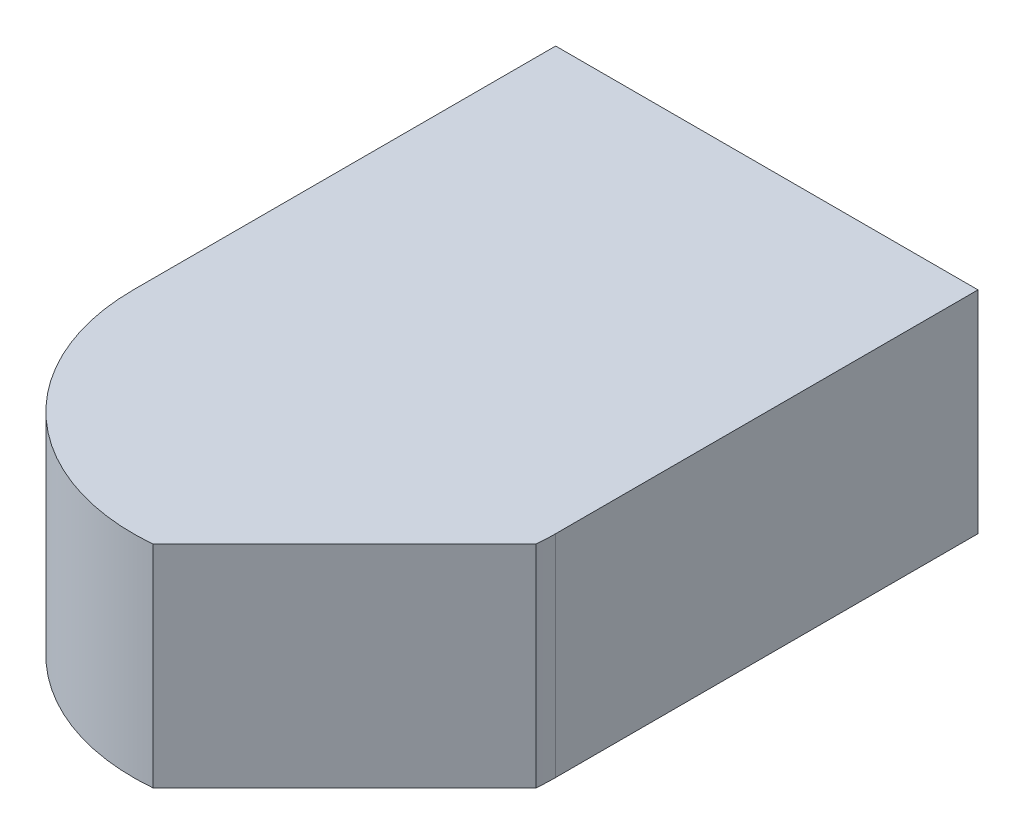
ISO-10303-21;
HEADER;
FILE_DESCRIPTION(('STEP AP214'),'2;1');
FILE_NAME('part.step','',(''),(''),'','','');
FILE_SCHEMA(('AUTOMOTIVE_DESIGN { 1 0 10303 214 1 1 1 1 }'));
ENDSEC;
DATA;
#1=APPLICATION_CONTEXT('core data for automotive mechanical design processes');
#2=APPLICATION_PROTOCOL_DEFINITION('international standard','automotive_design',2000,#1);
#3=PRODUCT_CONTEXT('',#1,'mechanical');
#4=PRODUCT('Part','Part','',(#3));
#5=PRODUCT_RELATED_PRODUCT_CATEGORY('part','',(#4));
#6=PRODUCT_DEFINITION_FORMATION('','',#4);
#7=PRODUCT_DEFINITION_CONTEXT('part definition',#1,'design');
#8=PRODUCT_DEFINITION('design','',#6,#7);
#9=PRODUCT_DEFINITION_SHAPE('','',#8);
#10=(LENGTH_UNIT() NAMED_UNIT(*) SI_UNIT(.MILLI.,.METRE.));
#11=(NAMED_UNIT(*) PLANE_ANGLE_UNIT() SI_UNIT($,.RADIAN.));
#12=(NAMED_UNIT(*) SI_UNIT($,.STERADIAN.) SOLID_ANGLE_UNIT());
#13=UNCERTAINTY_MEASURE_WITH_UNIT(LENGTH_MEASURE(1.E-05),#10,'distance_accuracy_value','');
#14=(GEOMETRIC_REPRESENTATION_CONTEXT(3) GLOBAL_UNCERTAINTY_ASSIGNED_CONTEXT((#13)) GLOBAL_UNIT_ASSIGNED_CONTEXT((#10,
#11,#12)) REPRESENTATION_CONTEXT('',''));
#15=CARTESIAN_POINT('',(0.,0.,0.));
#16=DIRECTION('',(0.,0.,1.));
#17=DIRECTION('',(1.,0.,0.));
#18=AXIS2_PLACEMENT_3D('',#15,#16,#17);
#19=CARTESIAN_POINT('',(0.,0.,0.));
#20=DIRECTION('',(0.,1.,0.));
#21=DIRECTION('',(1.,0.,0.));
#22=AXIS2_PLACEMENT_3D('',#19,#20,#21);
#23=PLANE('',#22);
#24=CARTESIAN_POINT('',(0.8,0.,-2.05));
#25=DIRECTION('',(0.,1.,0.));
#26=DIRECTION('',(-1.,0.,0.));
#27=AXIS2_PLACEMENT_3D('',#24,#25,#26);
#28=CIRCLE('',#27,0.1);
#29=CARTESIAN_POINT('',(0.7,0.,-2.05));
#30=VERTEX_POINT('',#29);
#31=CARTESIAN_POINT('',(0.808982925758,0.,-1.950404281996));
#32=VERTEX_POINT('',#31);
#33=EDGE_CURVE('E11',#30,#32,#28,.T.);
#34=ORIENTED_EDGE('',*,*,#33,.F.);
#35=DIRECTION('',(0.,0.,1.));
#36=VECTOR('',#35,1.);
#37=CARTESIAN_POINT('',(0.7,0.,-2.25));
#38=LINE('',#37,#36);
#39=CARTESIAN_POINT('',(0.7,0.,-2.25));
#40=VERTEX_POINT('',#39);
#41=EDGE_CURVE('E25',#40,#30,#38,.T.);
#42=ORIENTED_EDGE('',*,*,#41,.F.);
#43=DIRECTION('',(-1.,0.,0.));
#44=VECTOR('',#43,1.);
#45=CARTESIAN_POINT('',(0.9,0.,-2.25));
#46=LINE('',#45,#44);
#47=CARTESIAN_POINT('',(0.9,0.,-2.25));
#48=VERTEX_POINT('',#47);
#49=EDGE_CURVE('E145',#48,#40,#46,.T.);
#50=ORIENTED_EDGE('',*,*,#49,.F.);
#51=DIRECTION('',(0.,0.,-1.));
#52=VECTOR('',#51,1.);
#53=CARTESIAN_POINT('',(0.9,0.,-2.05));
#54=LINE('',#53,#52);
#55=CARTESIAN_POINT('',(0.9,0.,-2.05));
#56=VERTEX_POINT('',#55);
#57=EDGE_CURVE('E141',#56,#48,#54,.T.);
#58=ORIENTED_EDGE('',*,*,#57,.F.);
#59=CARTESIAN_POINT('',(0.8,0.,-2.05));
#60=DIRECTION('',(0.,1.,0.));
#61=DIRECTION('',(0.995957180044505,0.,0.0898292575823554));
#62=AXIS2_PLACEMENT_3D('',#59,#60,#61);
#63=CIRCLE('',#62,0.1);
#64=CARTESIAN_POINT('',(0.899595718005,0.,-2.041017074242));
#65=VERTEX_POINT('',#64);
#66=EDGE_CURVE('E89',#65,#56,#63,.T.);
#67=ORIENTED_EDGE('',*,*,#66,.F.);
#68=DIRECTION('',(-0.707106781186548,0.,0.707106781186548));
#69=VECTOR('',#68,1.);
#70=CARTESIAN_POINT('',(0.899595718005,0.,-2.041017074242));
#71=LINE('',#70,#69);
#72=EDGE_CURVE('E134',#65,#32,#71,.T.);
#73=ORIENTED_EDGE('',*,*,#72,.T.);
#74=EDGE_LOOP('',(#34,#42,#50,#58,#67,#73));
#75=FACE_BOUND('',#74,.T.);
#76=ADVANCED_FACE('F17',(#75),#23,.F.);
#77=CARTESIAN_POINT('',(0.899595718005,-0.02,-2.041017074242));
#78=DIRECTION('',(-0.707106781186548,0.,-0.707106781186548));
#79=DIRECTION('',(-0.707106781186548,0.,0.707106781186548));
#80=AXIS2_PLACEMENT_3D('',#77,#78,#79);
#81=PLANE('',#80);
#82=DIRECTION('',(0.,1.,0.));
#83=VECTOR('',#82,1.);
#84=CARTESIAN_POINT('',(0.899595718004,0.,-2.041017074242));
#85=LINE('',#84,#83);
#86=CARTESIAN_POINT('',(0.899595718004,0.1,-2.041017074242));
#87=VERTEX_POINT('',#86);
#88=EDGE_CURVE('E130',#65,#87,#85,.T.);
#89=ORIENTED_EDGE('',*,*,#88,.T.);
#90=DIRECTION('',(-0.707106781186548,0.,0.707106781186548));
#91=VECTOR('',#90,1.);
#92=CARTESIAN_POINT('',(0.899595718004,0.1,-2.041017074242));
#93=LINE('',#92,#91);
#94=CARTESIAN_POINT('',(0.808982925758,0.1,-1.950404281996));
#95=VERTEX_POINT('',#94);
#96=EDGE_CURVE('E84',#87,#95,#93,.T.);
#97=ORIENTED_EDGE('',*,*,#96,.T.);
#98=DIRECTION('',(0.,1.,0.));
#99=VECTOR('',#98,1.);
#100=CARTESIAN_POINT('',(0.808982925758,0.,-1.950404281996));
#101=LINE('',#100,#99);
#102=EDGE_CURVE('E122',#32,#95,#101,.T.);
#103=ORIENTED_EDGE('',*,*,#102,.F.);
#104=ORIENTED_EDGE('',*,*,#72,.F.);
#105=EDGE_LOOP('',(#89,#97,#103,#104));
#106=FACE_BOUND('',#105,.T.);
#107=ADVANCED_FACE('F161',(#106),#81,.F.);
#108=CARTESIAN_POINT('',(0.8,0.,-2.05));
#109=DIRECTION('',(0.,1.,0.));
#110=DIRECTION('',(0.674600156544445,0.,-0.738183330067952));
#111=AXIS2_PLACEMENT_3D('',#108,#109,#110);
#112=CYLINDRICAL_SURFACE('',#111,0.1);
#113=CARTESIAN_POINT('',(0.8,0.1,-2.05));
#114=DIRECTION('',(0.,1.,0.));
#115=DIRECTION('',(-1.,0.,0.));
#116=AXIS2_PLACEMENT_3D('',#113,#114,#115);
#117=CIRCLE('',#116,0.1);
#118=CARTESIAN_POINT('',(0.7,0.1,-2.05));
#119=VERTEX_POINT('',#118);
#120=EDGE_CURVE('E118',#119,#95,#117,.T.);
#121=ORIENTED_EDGE('',*,*,#120,.F.);
#122=DIRECTION('',(0.,1.,0.));
#123=VECTOR('',#122,1.);
#124=CARTESIAN_POINT('',(0.7,0.,-2.05));
#125=LINE('',#124,#123);
#126=EDGE_CURVE('E113',#30,#119,#125,.T.);
#127=ORIENTED_EDGE('',*,*,#126,.F.);
#128=ORIENTED_EDGE('',*,*,#33,.T.);
#129=ORIENTED_EDGE('',*,*,#102,.T.);
#130=EDGE_LOOP('',(#121,#127,#128,#129));
#131=FACE_BOUND('',#130,.T.);
#132=ADVANCED_FACE('F163',(#131),#112,.T.);
#133=CARTESIAN_POINT('',(0.7,0.,-2.25));
#134=DIRECTION('',(-1.,0.,0.));
#135=DIRECTION('',(0.,0.,1.));
#136=AXIS2_PLACEMENT_3D('',#133,#134,#135);
#137=PLANE('',#136);
#138=ORIENTED_EDGE('',*,*,#126,.T.);
#139=DIRECTION('',(0.,0.,1.));
#140=VECTOR('',#139,1.);
#141=CARTESIAN_POINT('',(0.7,0.1,-2.25));
#142=LINE('',#141,#140);
#143=CARTESIAN_POINT('',(0.7,0.1,-2.25));
#144=VERTEX_POINT('',#143);
#145=EDGE_CURVE('E108',#144,#119,#142,.T.);
#146=ORIENTED_EDGE('',*,*,#145,.F.);
#147=DIRECTION('',(0.,1.,0.));
#148=VECTOR('',#147,1.);
#149=CARTESIAN_POINT('',(0.7,0.,-2.25));
#150=LINE('',#149,#148);
#151=EDGE_CURVE('E103',#40,#144,#150,.T.);
#152=ORIENTED_EDGE('',*,*,#151,.F.);
#153=ORIENTED_EDGE('',*,*,#41,.T.);
#154=EDGE_LOOP('',(#138,#146,#152,#153));
#155=FACE_BOUND('',#154,.T.);
#156=ADVANCED_FACE('F155',(#155),#137,.T.);
#157=CARTESIAN_POINT('',(0.9,0.,-2.25));
#158=DIRECTION('',(0.,0.,-1.));
#159=DIRECTION('',(-1.,0.,0.));
#160=AXIS2_PLACEMENT_3D('',#157,#158,#159);
#161=PLANE('',#160);
#162=ORIENTED_EDGE('',*,*,#151,.T.);
#163=DIRECTION('',(-1.,0.,0.));
#164=VECTOR('',#163,1.);
#165=CARTESIAN_POINT('',(0.9,0.1,-2.25));
#166=LINE('',#165,#164);
#167=CARTESIAN_POINT('',(0.9,0.1,-2.25));
#168=VERTEX_POINT('',#167);
#169=EDGE_CURVE('E99',#168,#144,#166,.T.);
#170=ORIENTED_EDGE('',*,*,#169,.F.);
#171=DIRECTION('',(0.,1.,0.));
#172=VECTOR('',#171,1.);
#173=CARTESIAN_POINT('',(0.9,0.,-2.25));
#174=LINE('',#173,#172);
#175=EDGE_CURVE('E75',#48,#168,#174,.T.);
#176=ORIENTED_EDGE('',*,*,#175,.F.);
#177=ORIENTED_EDGE('',*,*,#49,.T.);
#178=EDGE_LOOP('',(#162,#170,#176,#177));
#179=FACE_BOUND('',#178,.T.);
#180=ADVANCED_FACE('F157',(#179),#161,.T.);
#181=CARTESIAN_POINT('',(0.9,0.,-2.05));
#182=DIRECTION('',(1.,0.,0.));
#183=DIRECTION('',(0.,0.,-1.));
#184=AXIS2_PLACEMENT_3D('',#181,#182,#183);
#185=PLANE('',#184);
#186=ORIENTED_EDGE('',*,*,#175,.T.);
#187=DIRECTION('',(0.,0.,-1.));
#188=VECTOR('',#187,1.);
#189=CARTESIAN_POINT('',(0.9,0.1,-2.05));
#190=LINE('',#189,#188);
#191=CARTESIAN_POINT('',(0.9,0.1,-2.05));
#192=VERTEX_POINT('',#191);
#193=EDGE_CURVE('E67',#192,#168,#190,.T.);
#194=ORIENTED_EDGE('',*,*,#193,.F.);
#195=DIRECTION('',(0.,1.,0.));
#196=VECTOR('',#195,1.);
#197=CARTESIAN_POINT('',(0.9,0.,-2.05));
#198=LINE('',#197,#196);
#199=EDGE_CURVE('E72',#56,#192,#198,.T.);
#200=ORIENTED_EDGE('',*,*,#199,.F.);
#201=ORIENTED_EDGE('',*,*,#57,.T.);
#202=EDGE_LOOP('',(#186,#194,#200,#201));
#203=FACE_BOUND('',#202,.T.);
#204=ADVANCED_FACE('F69',(#203),#185,.T.);
#205=CARTESIAN_POINT('',(0.8,0.,-2.05));
#206=DIRECTION('',(0.,1.,0.));
#207=DIRECTION('',(-0.998988783731956,0.,-0.0449600931688024));
#208=AXIS2_PLACEMENT_3D('',#205,#206,#207);
#209=CYLINDRICAL_SURFACE('',#208,0.1);
#210=ORIENTED_EDGE('',*,*,#66,.T.);
#211=ORIENTED_EDGE('',*,*,#199,.T.);
#212=CARTESIAN_POINT('',(0.8,0.1,-2.05));
#213=DIRECTION('',(0.,1.,0.));
#214=DIRECTION('',(0.995957180044505,0.,0.0898292575823554));
#215=AXIS2_PLACEMENT_3D('',#212,#213,#214);
#216=CIRCLE('',#215,0.1);
#217=EDGE_CURVE('E81',#87,#192,#216,.T.);
#218=ORIENTED_EDGE('',*,*,#217,.F.);
#219=ORIENTED_EDGE('',*,*,#88,.F.);
#220=EDGE_LOOP('',(#210,#211,#218,#219));
#221=FACE_BOUND('',#220,.T.);
#222=ADVANCED_FACE('F88',(#221),#209,.T.);
#223=CARTESIAN_POINT('',(0.,0.1,0.));
#224=DIRECTION('',(0.,1.,0.));
#225=DIRECTION('',(1.,0.,0.));
#226=AXIS2_PLACEMENT_3D('',#223,#224,#225);
#227=PLANE('',#226);
#228=ORIENTED_EDGE('',*,*,#217,.T.);
#229=ORIENTED_EDGE('',*,*,#193,.T.);
#230=ORIENTED_EDGE('',*,*,#169,.T.);
#231=ORIENTED_EDGE('',*,*,#145,.T.);
#232=ORIENTED_EDGE('',*,*,#120,.T.);
#233=ORIENTED_EDGE('',*,*,#96,.F.);
#234=EDGE_LOOP('',(#228,#229,#230,#231,#232,#233));
#235=FACE_BOUND('',#234,.T.);
#236=ADVANCED_FACE('F82',(#235),#227,.T.);
#237=CLOSED_SHELL('',(#76,#107,#132,#156,#180,#204,#222,#236));
#238=MANIFOLD_SOLID_BREP('B1',#237);
#239=ADVANCED_BREP_SHAPE_REPRESENTATION('',(#18,#238),#14);
#240=SHAPE_DEFINITION_REPRESENTATION(#9,#239);
ENDSEC;
END-ISO-10303-21;
